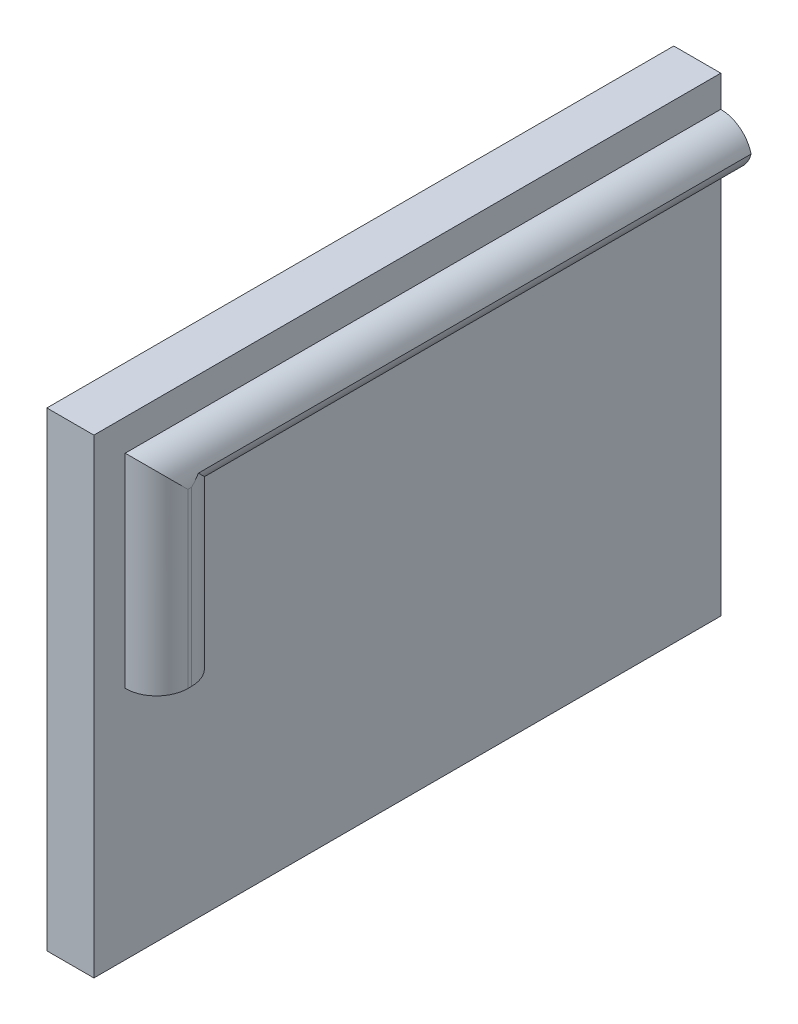
ISO-10303-21;
HEADER;
FILE_DESCRIPTION(('STEP AP214'),'2;1');
FILE_NAME('part.step','',(''),(''),'','','');
FILE_SCHEMA(('AUTOMOTIVE_DESIGN { 1 0 10303 214 1 1 1 1 }'));
ENDSEC;
DATA;
#1=APPLICATION_CONTEXT('core data for automotive mechanical design processes');
#2=APPLICATION_PROTOCOL_DEFINITION('international standard','automotive_design',2000,#1);
#3=PRODUCT_CONTEXT('',#1,'mechanical');
#4=PRODUCT('Part','Part','',(#3));
#5=PRODUCT_RELATED_PRODUCT_CATEGORY('part','',(#4));
#6=PRODUCT_DEFINITION_FORMATION('','',#4);
#7=PRODUCT_DEFINITION_CONTEXT('part definition',#1,'design');
#8=PRODUCT_DEFINITION('design','',#6,#7);
#9=PRODUCT_DEFINITION_SHAPE('','',#8);
#10=(LENGTH_UNIT() NAMED_UNIT(*) SI_UNIT(.MILLI.,.METRE.));
#11=(NAMED_UNIT(*) PLANE_ANGLE_UNIT() SI_UNIT($,.RADIAN.));
#12=(NAMED_UNIT(*) SI_UNIT($,.STERADIAN.) SOLID_ANGLE_UNIT());
#13=UNCERTAINTY_MEASURE_WITH_UNIT(LENGTH_MEASURE(1.E-05),#10,'distance_accuracy_value','');
#14=(GEOMETRIC_REPRESENTATION_CONTEXT(3) GLOBAL_UNCERTAINTY_ASSIGNED_CONTEXT((#13)) GLOBAL_UNIT_ASSIGNED_CONTEXT((#10,
#11,#12)) REPRESENTATION_CONTEXT('',''));
#15=CARTESIAN_POINT('',(0.,0.,0.));
#16=DIRECTION('',(0.,0.,1.));
#17=DIRECTION('',(1.,0.,0.));
#18=AXIS2_PLACEMENT_3D('',#15,#16,#17);
#19=CARTESIAN_POINT('',(3.,15.,-20.));
#20=DIRECTION('',(0.,0.,1.));
#21=DIRECTION('',(0.,-1.,0.));
#22=AXIS2_PLACEMENT_3D('',#19,#20,#21);
#23=PLANE('',#22);
#24=CARTESIAN_POINT('',(3.,11.,-20.));
#25=DIRECTION('',(0.,0.,1.));
#26=DIRECTION('',(0.,-1.,0.));
#27=AXIS2_PLACEMENT_3D('',#24,#25,#26);
#28=CIRCLE('',#27,2.);
#29=CARTESIAN_POINT('',(3.,13.,-20.));
#30=VERTEX_POINT('',#29);
#31=CARTESIAN_POINT('',(4.93649167310371,11.5,-20.));
#32=VERTEX_POINT('',#31);
#33=EDGE_CURVE('E46',#30,#32,#28,.F.);
#34=ORIENTED_EDGE('',*,*,#33,.T.);
#35=CARTESIAN_POINT('',(3.,12.,-20.));
#36=DIRECTION('',(0.,0.,1.));
#37=DIRECTION('',(0.,-1.,0.));
#38=AXIS2_PLACEMENT_3D('',#35,#36,#37);
#39=CIRCLE('',#38,2.);
#40=CARTESIAN_POINT('',(3.,10.,-20.));
#41=VERTEX_POINT('',#40);
#42=EDGE_CURVE('E11',#32,#41,#39,.F.);
#43=ORIENTED_EDGE('',*,*,#42,.T.);
#44=DIRECTION('',(0.,1.,0.));
#45=VECTOR('',#44,1.);
#46=CARTESIAN_POINT('',(3.,15.,-20.));
#47=LINE('',#46,#45);
#48=CARTESIAN_POINT('',(3.,-15.,-20.));
#49=VERTEX_POINT('',#48);
#50=EDGE_CURVE('E175',#49,#41,#47,.T.);
#51=ORIENTED_EDGE('',*,*,#50,.F.);
#52=DIRECTION('',(-1.,0.,0.));
#53=VECTOR('',#52,1.);
#54=CARTESIAN_POINT('',(3.,-15.,-20.));
#55=LINE('',#54,#53);
#56=CARTESIAN_POINT('',(0.,-15.,-20.));
#57=VERTEX_POINT('',#56);
#58=EDGE_CURVE('E155',#49,#57,#55,.T.);
#59=ORIENTED_EDGE('',*,*,#58,.T.);
#60=DIRECTION('',(0.,1.,0.));
#61=VECTOR('',#60,1.);
#62=CARTESIAN_POINT('',(0.,15.,-20.));
#63=LINE('',#62,#61);
#64=CARTESIAN_POINT('',(0.,15.,-20.));
#65=VERTEX_POINT('',#64);
#66=EDGE_CURVE('E166',#57,#65,#63,.T.);
#67=ORIENTED_EDGE('',*,*,#66,.T.);
#68=DIRECTION('',(-1.,0.,0.));
#69=VECTOR('',#68,1.);
#70=CARTESIAN_POINT('',(3.,15.,-20.));
#71=LINE('',#70,#69);
#72=CARTESIAN_POINT('',(3.,15.,-20.));
#73=VERTEX_POINT('',#72);
#74=EDGE_CURVE('E146',#73,#65,#71,.T.);
#75=ORIENTED_EDGE('',*,*,#74,.F.);
#76=EDGE_CURVE('E161',#30,#73,#47,.T.);
#77=ORIENTED_EDGE('',*,*,#76,.F.);
#78=EDGE_LOOP('',(#34,#43,#51,#59,#67,#75,#77));
#79=FACE_BOUND('',#78,.T.);
#80=ADVANCED_FACE('F36',(#79),#23,.F.);
#81=CARTESIAN_POINT('',(3.,15.,20.));
#82=DIRECTION('',(0.,-1.,0.));
#83=DIRECTION('',(0.,0.,-1.));
#84=AXIS2_PLACEMENT_3D('',#81,#82,#83);
#85=PLANE('',#84);
#86=DIRECTION('',(0.,0.,1.));
#87=VECTOR('',#86,1.);
#88=CARTESIAN_POINT('',(0.,15.,20.));
#89=LINE('',#88,#87);
#90=CARTESIAN_POINT('',(0.,15.,20.));
#91=VERTEX_POINT('',#90);
#92=EDGE_CURVE('E164',#65,#91,#89,.T.);
#93=ORIENTED_EDGE('',*,*,#92,.T.);
#94=DIRECTION('',(-1.,0.,0.));
#95=VECTOR('',#94,1.);
#96=CARTESIAN_POINT('',(3.,15.,20.));
#97=LINE('',#96,#95);
#98=CARTESIAN_POINT('',(3.,15.,20.));
#99=VERTEX_POINT('',#98);
#100=EDGE_CURVE('E149',#99,#91,#97,.T.);
#101=ORIENTED_EDGE('',*,*,#100,.F.);
#102=DIRECTION('',(0.,0.,1.));
#103=VECTOR('',#102,1.);
#104=CARTESIAN_POINT('',(3.,15.,20.));
#105=LINE('',#104,#103);
#106=EDGE_CURVE('E173',#73,#99,#105,.T.);
#107=ORIENTED_EDGE('',*,*,#106,.F.);
#108=ORIENTED_EDGE('',*,*,#74,.T.);
#109=EDGE_LOOP('',(#93,#101,#107,#108));
#110=FACE_BOUND('',#109,.T.);
#111=ADVANCED_FACE('F210',(#110),#85,.F.);
#112=CARTESIAN_POINT('',(3.,15.,20.));
#113=DIRECTION('',(0.,0.,-1.));
#114=DIRECTION('',(0.,1.,0.));
#115=AXIS2_PLACEMENT_3D('',#112,#113,#114);
#116=PLANE('',#115);
#117=DIRECTION('',(0.,-1.,0.));
#118=VECTOR('',#117,1.);
#119=CARTESIAN_POINT('',(0.,15.,20.));
#120=LINE('',#119,#118);
#121=CARTESIAN_POINT('',(0.,-15.,20.));
#122=VERTEX_POINT('',#121);
#123=EDGE_CURVE('E162',#91,#122,#120,.T.);
#124=ORIENTED_EDGE('',*,*,#123,.T.);
#125=DIRECTION('',(-1.,0.,0.));
#126=VECTOR('',#125,1.);
#127=CARTESIAN_POINT('',(3.,-15.,20.));
#128=LINE('',#127,#126);
#129=CARTESIAN_POINT('',(3.,-15.,20.));
#130=VERTEX_POINT('',#129);
#131=EDGE_CURVE('E152',#130,#122,#128,.T.);
#132=ORIENTED_EDGE('',*,*,#131,.F.);
#133=DIRECTION('',(0.,-1.,0.));
#134=VECTOR('',#133,1.);
#135=CARTESIAN_POINT('',(3.,15.,20.));
#136=LINE('',#135,#134);
#137=EDGE_CURVE('E171',#99,#130,#136,.T.);
#138=ORIENTED_EDGE('',*,*,#137,.F.);
#139=ORIENTED_EDGE('',*,*,#100,.T.);
#140=EDGE_LOOP('',(#124,#132,#138,#139));
#141=FACE_BOUND('',#140,.T.);
#142=ADVANCED_FACE('F224',(#141),#116,.F.);
#143=CARTESIAN_POINT('',(3.,-15.,20.));
#144=DIRECTION('',(0.,1.,0.));
#145=DIRECTION('',(0.,0.,1.));
#146=AXIS2_PLACEMENT_3D('',#143,#144,#145);
#147=PLANE('',#146);
#148=DIRECTION('',(0.,0.,-1.));
#149=VECTOR('',#148,1.);
#150=CARTESIAN_POINT('',(0.,-15.,20.));
#151=LINE('',#150,#149);
#152=EDGE_CURVE('E159',#122,#57,#151,.T.);
#153=ORIENTED_EDGE('',*,*,#152,.T.);
#154=ORIENTED_EDGE('',*,*,#58,.F.);
#155=DIRECTION('',(0.,0.,-1.));
#156=VECTOR('',#155,1.);
#157=CARTESIAN_POINT('',(3.,-15.,20.));
#158=LINE('',#157,#156);
#159=EDGE_CURVE('E158',#130,#49,#158,.T.);
#160=ORIENTED_EDGE('',*,*,#159,.F.);
#161=ORIENTED_EDGE('',*,*,#131,.T.);
#162=EDGE_LOOP('',(#153,#154,#160,#161));
#163=FACE_BOUND('',#162,.T.);
#164=ADVANCED_FACE('F229',(#163),#147,.F.);
#165=CARTESIAN_POINT('',(3.,0.,0.));
#166=DIRECTION('',(1.,0.,0.));
#167=DIRECTION('',(0.,0.,-1.));
#168=AXIS2_PLACEMENT_3D('',#165,#166,#167);
#169=PLANE('',#168);
#170=DIRECTION('',(0.,0.,1.));
#171=VECTOR('',#170,1.);
#172=CARTESIAN_POINT('',(3.,13.,0.));
#173=LINE('',#172,#171);
#174=CARTESIAN_POINT('',(3.,13.,18.));
#175=VERTEX_POINT('',#174);
#176=EDGE_CURVE('E182',#30,#175,#173,.T.);
#177=ORIENTED_EDGE('',*,*,#176,.F.);
#178=ORIENTED_EDGE('',*,*,#76,.T.);
#179=ORIENTED_EDGE('',*,*,#106,.T.);
#180=ORIENTED_EDGE('',*,*,#137,.T.);
#181=ORIENTED_EDGE('',*,*,#159,.T.);
#182=ORIENTED_EDGE('',*,*,#50,.T.);
#183=DIRECTION('',(0.,0.,1.));
#184=VECTOR('',#183,1.);
#185=CARTESIAN_POINT('',(3.,9.99999999999999,0.));
#186=LINE('',#185,#184);
#187=CARTESIAN_POINT('',(3.,9.99999999999999,13.7685033262154));
#188=VERTEX_POINT('',#187);
#189=EDGE_CURVE('E185',#41,#188,#186,.T.);
#190=ORIENTED_EDGE('',*,*,#189,.T.);
#191=DIRECTION('',(0.,-1.,0.));
#192=VECTOR('',#191,1.);
#193=CARTESIAN_POINT('',(3.,0.,13.7685033262154));
#194=LINE('',#193,#192);
#195=CARTESIAN_POINT('',(3.,0.,13.7685033262154));
#196=VERTEX_POINT('',#195);
#197=EDGE_CURVE('E121',#188,#196,#194,.T.);
#198=ORIENTED_EDGE('',*,*,#197,.T.);
#199=DIRECTION('',(0.,0.,-1.));
#200=VECTOR('',#199,1.);
#201=CARTESIAN_POINT('',(3.,0.,0.));
#202=LINE('',#201,#200);
#203=CARTESIAN_POINT('',(3.,0.,18.));
#204=VERTEX_POINT('',#203);
#205=EDGE_CURVE('E177',#204,#196,#202,.T.);
#206=ORIENTED_EDGE('',*,*,#205,.F.);
#207=DIRECTION('',(0.,-1.,0.));
#208=VECTOR('',#207,1.);
#209=CARTESIAN_POINT('',(3.,0.,18.));
#210=LINE('',#209,#208);
#211=EDGE_CURVE('E179',#175,#204,#210,.T.);
#212=ORIENTED_EDGE('',*,*,#211,.F.);
#213=EDGE_LOOP('',(#177,#178,#179,#180,#181,#182,#190,#198,#206,#212));
#214=FACE_BOUND('',#213,.T.);
#215=ADVANCED_FACE('F197',(#214),#169,.T.);
#216=CARTESIAN_POINT('',(0.,0.,0.));
#217=DIRECTION('',(1.,0.,0.));
#218=DIRECTION('',(0.,0.,-1.));
#219=AXIS2_PLACEMENT_3D('',#216,#217,#218);
#220=PLANE('',#219);
#221=ORIENTED_EDGE('',*,*,#66,.F.);
#222=ORIENTED_EDGE('',*,*,#152,.F.);
#223=ORIENTED_EDGE('',*,*,#123,.F.);
#224=ORIENTED_EDGE('',*,*,#92,.F.);
#225=EDGE_LOOP('',(#221,#222,#223,#224));
#226=FACE_BOUND('',#225,.T.);
#227=ADVANCED_FACE('F205',(#226),#220,.F.);
#228=CARTESIAN_POINT('',(5.,0.,0.));
#229=DIRECTION('',(0.,1.,0.));
#230=DIRECTION('',(0.,0.,1.));
#231=AXIS2_PLACEMENT_3D('',#228,#229,#230);
#232=PLANE('',#231);
#233=DIRECTION('',(0.,0.,-1.));
#234=VECTOR('',#233,1.);
#235=CARTESIAN_POINT('',(5.,0.,0.));
#236=LINE('',#235,#234);
#237=CARTESIAN_POINT('',(5.,0.,16.));
#238=VERTEX_POINT('',#237);
#239=CARTESIAN_POINT('',(5.,0.,15.7685033262154));
#240=VERTEX_POINT('',#239);
#241=EDGE_CURVE('E169',#238,#240,#236,.T.);
#242=ORIENTED_EDGE('',*,*,#241,.F.);
#243=CARTESIAN_POINT('',(3.,0.,16.));
#244=DIRECTION('',(0.,1.,0.));
#245=DIRECTION('',(0.,0.,1.));
#246=AXIS2_PLACEMENT_3D('',#243,#244,#245);
#247=CIRCLE('',#246,2.);
#248=EDGE_CURVE('E136',#238,#204,#247,.F.);
#249=ORIENTED_EDGE('',*,*,#248,.T.);
#250=ORIENTED_EDGE('',*,*,#205,.T.);
#251=CARTESIAN_POINT('',(3.,0.,15.7685033262154));
#252=DIRECTION('',(0.,1.,0.));
#253=DIRECTION('',(0.,0.,1.));
#254=AXIS2_PLACEMENT_3D('',#251,#252,#253);
#255=CIRCLE('',#254,2.);
#256=EDGE_CURVE('E138',#196,#240,#255,.F.);
#257=ORIENTED_EDGE('',*,*,#256,.T.);
#258=EDGE_LOOP('',(#242,#249,#250,#257));
#259=FACE_BOUND('',#258,.T.);
#260=ADVANCED_FACE('F194',(#259),#232,.F.);
#261=CARTESIAN_POINT('',(5.,0.,0.));
#262=DIRECTION('',(1.,0.,0.));
#263=DIRECTION('',(0.,0.,-1.));
#264=AXIS2_PLACEMENT_3D('',#261,#262,#263);
#265=PLANE('',#264);
#266=DIRECTION('',(0.,0.,1.));
#267=VECTOR('',#266,1.);
#268=CARTESIAN_POINT('',(5.,11.,18.));
#269=LINE('',#268,#267);
#270=CARTESIAN_POINT('',(5.,11.,15.7685033262154));
#271=VERTEX_POINT('',#270);
#272=CARTESIAN_POINT('',(5.,11.,16.));
#273=VERTEX_POINT('',#272);
#274=EDGE_CURVE('E129',#271,#273,#269,.T.);
#275=ORIENTED_EDGE('',*,*,#274,.T.);
#276=DIRECTION('',(0.,-1.,0.));
#277=VECTOR('',#276,1.);
#278=CARTESIAN_POINT('',(5.,0.,16.));
#279=LINE('',#278,#277);
#280=EDGE_CURVE('E140',#273,#238,#279,.T.);
#281=ORIENTED_EDGE('',*,*,#280,.T.);
#282=ORIENTED_EDGE('',*,*,#241,.T.);
#283=DIRECTION('',(0.,-1.,0.));
#284=VECTOR('',#283,1.);
#285=CARTESIAN_POINT('',(5.,0.,15.7685033262154));
#286=LINE('',#285,#284);
#287=EDGE_CURVE('E143',#240,#271,#286,.F.);
#288=ORIENTED_EDGE('',*,*,#287,.T.);
#289=EDGE_LOOP('',(#275,#281,#282,#288));
#290=FACE_BOUND('',#289,.T.);
#291=ADVANCED_FACE('F191',(#290),#265,.T.);
#292=CARTESIAN_POINT('',(3.,12.,0.));
#293=DIRECTION('',(0.,0.,1.));
#294=DIRECTION('',(0.,-1.,0.));
#295=AXIS2_PLACEMENT_3D('',#292,#293,#294);
#296=CYLINDRICAL_SURFACE('',#295,2.);
#297=CARTESIAN_POINT('',(3.,12.,15.7685033262154));
#298=DIRECTION('',(0.,-0.707106781186548,0.707106781186547));
#299=DIRECTION('',(0.,-0.707106781186547,-0.707106781186548));
#300=AXIS2_PLACEMENT_3D('',#297,#298,#299);
#301=ELLIPSE('',#300,2.82842712474619,2.);
#302=CARTESIAN_POINT('',(4.93649167310371,11.5,15.2685033262154));
#303=VERTEX_POINT('',#302);
#304=EDGE_CURVE('E40',#188,#303,#301,.T.);
#305=ORIENTED_EDGE('',*,*,#304,.F.);
#306=ORIENTED_EDGE('',*,*,#189,.F.);
#307=ORIENTED_EDGE('',*,*,#42,.F.);
#308=DIRECTION('',(0.,0.,-1.));
#309=VECTOR('',#308,1.);
#310=CARTESIAN_POINT('',(4.93649167310371,11.5,-0.885999999999997));
#311=LINE('',#310,#309);
#312=EDGE_CURVE('E124',#303,#32,#311,.T.);
#313=ORIENTED_EDGE('',*,*,#312,.F.);
#314=EDGE_LOOP('',(#305,#306,#307,#313));
#315=FACE_BOUND('',#314,.T.);
#316=ADVANCED_FACE('F38',(#315),#296,.T.);
#317=CARTESIAN_POINT('',(3.,0.,15.7685033262154));
#318=DIRECTION('',(0.,-1.,0.));
#319=DIRECTION('',(0.,0.,-1.));
#320=AXIS2_PLACEMENT_3D('',#317,#318,#319);
#321=CYLINDRICAL_SURFACE('',#320,2.);
#322=ORIENTED_EDGE('',*,*,#197,.F.);
#323=ORIENTED_EDGE('',*,*,#304,.T.);
#324=CARTESIAN_POINT('',(3.,11.,15.7685033262154));
#325=DIRECTION('',(0.,-0.707106781186547,-0.707106781186548));
#326=DIRECTION('',(0.,-0.707106781186547,0.707106781186547));
#327=AXIS2_PLACEMENT_3D('',#324,#325,#326);
#328=ELLIPSE('',#327,2.82842712474619,2.);
#329=EDGE_CURVE('E117',#271,#303,#328,.F.);
#330=ORIENTED_EDGE('',*,*,#329,.F.);
#331=ORIENTED_EDGE('',*,*,#287,.F.);
#332=ORIENTED_EDGE('',*,*,#256,.F.);
#333=EDGE_LOOP('',(#322,#323,#330,#331,#332));
#334=FACE_BOUND('',#333,.T.);
#335=ADVANCED_FACE('F114',(#334),#321,.T.);
#336=CARTESIAN_POINT('',(3.,11.,0.));
#337=DIRECTION('',(0.,0.,-1.));
#338=DIRECTION('',(0.,1.,0.));
#339=AXIS2_PLACEMENT_3D('',#336,#337,#338);
#340=CYLINDRICAL_SURFACE('',#339,2.);
#341=ORIENTED_EDGE('',*,*,#33,.F.);
#342=ORIENTED_EDGE('',*,*,#176,.T.);
#343=CARTESIAN_POINT('',(3.,11.,16.));
#344=DIRECTION('',(0.,0.707106781186547,-0.707106781186547));
#345=DIRECTION('',(0.,-0.707106781186547,-0.707106781186548));
#346=AXIS2_PLACEMENT_3D('',#343,#344,#345);
#347=ELLIPSE('',#346,2.82842712474619,2.);
#348=EDGE_CURVE('E130',#273,#175,#347,.F.);
#349=ORIENTED_EDGE('',*,*,#348,.F.);
#350=ORIENTED_EDGE('',*,*,#274,.F.);
#351=ORIENTED_EDGE('',*,*,#329,.T.);
#352=ORIENTED_EDGE('',*,*,#312,.T.);
#353=EDGE_LOOP('',(#341,#342,#349,#350,#351,#352));
#354=FACE_BOUND('',#353,.T.);
#355=ADVANCED_FACE('F127',(#354),#340,.T.);
#356=CARTESIAN_POINT('',(3.,0.,16.));
#357=DIRECTION('',(0.,1.,0.));
#358=DIRECTION('',(0.,0.,1.));
#359=AXIS2_PLACEMENT_3D('',#356,#357,#358);
#360=CYLINDRICAL_SURFACE('',#359,2.);
#361=ORIENTED_EDGE('',*,*,#348,.T.);
#362=ORIENTED_EDGE('',*,*,#211,.T.);
#363=ORIENTED_EDGE('',*,*,#248,.F.);
#364=ORIENTED_EDGE('',*,*,#280,.F.);
#365=EDGE_LOOP('',(#361,#362,#363,#364));
#366=FACE_BOUND('',#365,.T.);
#367=ADVANCED_FACE('F212',(#366),#360,.T.);
#368=CLOSED_SHELL('',(#80,#111,#142,#164,#215,#227,#260,#291,#316,#335,#355,#367));
#369=MANIFOLD_SOLID_BREP('B2',#368);
#370=ADVANCED_BREP_SHAPE_REPRESENTATION('',(#18,#369),#14);
#371=SHAPE_DEFINITION_REPRESENTATION(#9,#370);
ENDSEC;
END-ISO-10303-21;
